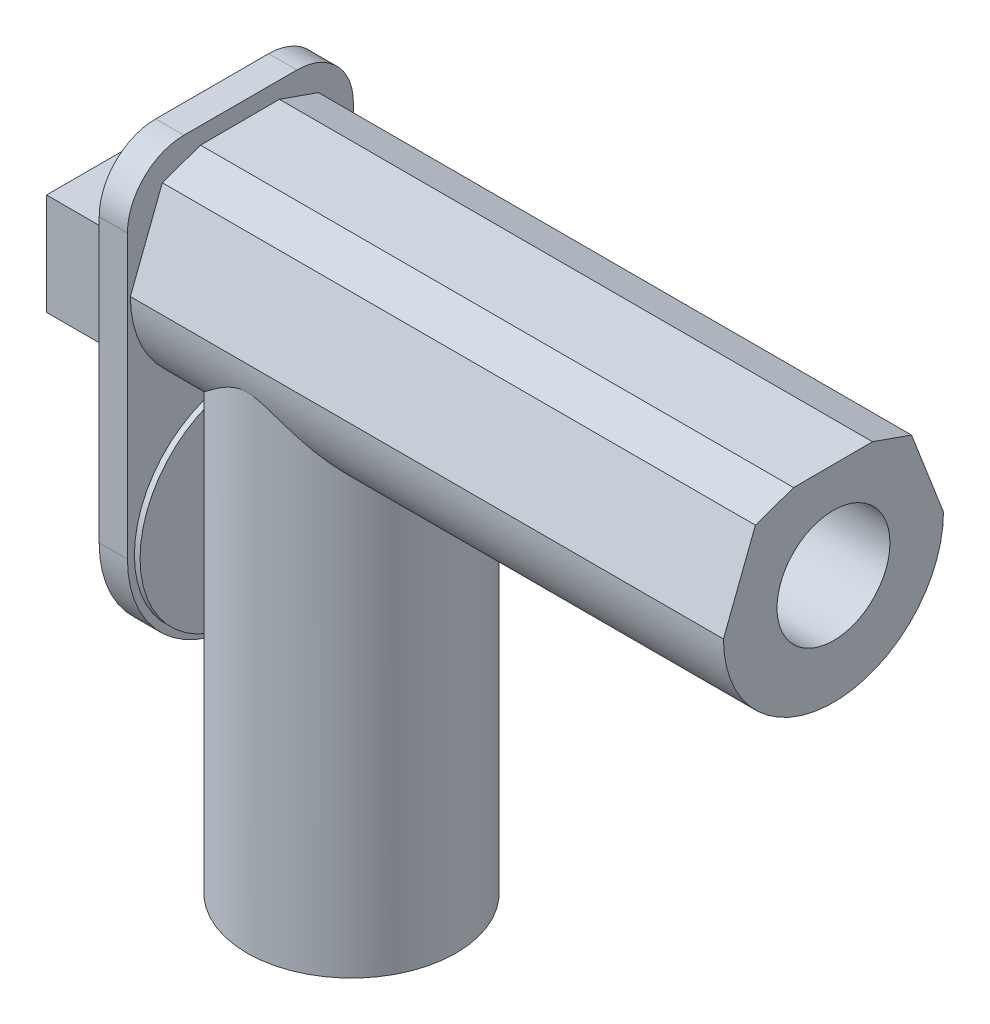
ISO-10303-21;
HEADER;
FILE_DESCRIPTION(('STEP AP214'),'2;1');
FILE_NAME('part.step','',(''),(''),'','','');
FILE_SCHEMA(('AUTOMOTIVE_DESIGN { 1 0 10303 214 1 1 1 1 }'));
ENDSEC;
DATA;
#1=APPLICATION_CONTEXT('core data for automotive mechanical design processes');
#2=APPLICATION_PROTOCOL_DEFINITION('international standard','automotive_design',2000,#1);
#3=PRODUCT_CONTEXT('',#1,'mechanical');
#4=PRODUCT('Part','Part','',(#3));
#5=PRODUCT_RELATED_PRODUCT_CATEGORY('part','',(#4));
#6=PRODUCT_DEFINITION_FORMATION('','',#4);
#7=PRODUCT_DEFINITION_CONTEXT('part definition',#1,'design');
#8=PRODUCT_DEFINITION('design','',#6,#7);
#9=PRODUCT_DEFINITION_SHAPE('','',#8);
#10=(LENGTH_UNIT() NAMED_UNIT(*) SI_UNIT(.MILLI.,.METRE.));
#11=(NAMED_UNIT(*) PLANE_ANGLE_UNIT() SI_UNIT($,.RADIAN.));
#12=(NAMED_UNIT(*) SI_UNIT($,.STERADIAN.) SOLID_ANGLE_UNIT());
#13=UNCERTAINTY_MEASURE_WITH_UNIT(LENGTH_MEASURE(1.E-05),#10,'distance_accuracy_value','');
#14=(GEOMETRIC_REPRESENTATION_CONTEXT(3) GLOBAL_UNCERTAINTY_ASSIGNED_CONTEXT((#13)) GLOBAL_UNIT_ASSIGNED_CONTEXT((#10,
#11,#12)) REPRESENTATION_CONTEXT('',''));
#15=CARTESIAN_POINT('',(0.,0.,0.));
#16=DIRECTION('',(0.,0.,1.));
#17=DIRECTION('',(1.,0.,0.));
#18=AXIS2_PLACEMENT_3D('',#15,#16,#17);
#19=CARTESIAN_POINT('',(21.277447397372,62.4620928878457,19.6760183189742));
#20=DIRECTION('',(-1.,0.,0.));
#21=DIRECTION('',(0.,0.,1.));
#22=AXIS2_PLACEMENT_3D('',#19,#20,#21);
#23=PLANE('',#22);
#24=DIRECTION('',(0.,-1.,0.));
#25=VECTOR('',#24,1.);
#26=CARTESIAN_POINT('',(21.277447397372,42.4620928878458,29.6760183189742));
#27=LINE('',#26,#25);
#28=CARTESIAN_POINT('',(21.277447397372,62.4620928878457,29.6760183189742));
#29=VERTEX_POINT('',#28);
#30=CARTESIAN_POINT('',(21.277447397372,12.4620928878458,29.6760183189742));
#31=VERTEX_POINT('',#30);
#32=EDGE_CURVE('E179',#29,#31,#27,.T.);
#33=ORIENTED_EDGE('',*,*,#32,.T.);
#34=CARTESIAN_POINT('',(21.277447397372,12.4620928878458,9.67601831897421));
#35=DIRECTION('',(1.,0.,0.));
#36=DIRECTION('',(0.,0.,-1.));
#37=AXIS2_PLACEMENT_3D('',#34,#35,#36);
#38=CIRCLE('',#37,20.);
#39=CARTESIAN_POINT('',(21.277447397372,12.4620928878458,-10.3239816810258));
#40=VERTEX_POINT('',#39);
#41=EDGE_CURVE('E181',#31,#40,#38,.T.);
#42=ORIENTED_EDGE('',*,*,#41,.T.);
#43=DIRECTION('',(0.,1.,0.));
#44=VECTOR('',#43,1.);
#45=CARTESIAN_POINT('',(21.277447397372,42.4620928878458,-10.3239816810258));
#46=LINE('',#45,#44);
#47=CARTESIAN_POINT('',(21.277447397372,62.4620928878457,-10.3239816810258));
#48=VERTEX_POINT('',#47);
#49=EDGE_CURVE('E184',#40,#48,#46,.T.);
#50=ORIENTED_EDGE('',*,*,#49,.T.);
#51=CARTESIAN_POINT('',(21.277447397372,62.4620928878457,-0.323981681025794));
#52=DIRECTION('',(1.,0.,0.));
#53=DIRECTION('',(0.,0.,-1.));
#54=AXIS2_PLACEMENT_3D('',#51,#52,#53);
#55=CIRCLE('',#54,10.);
#56=CARTESIAN_POINT('',(21.277447397372,72.4620928878457,-0.323981681025724));
#57=VERTEX_POINT('',#56);
#58=EDGE_CURVE('E186',#48,#57,#55,.T.);
#59=ORIENTED_EDGE('',*,*,#58,.T.);
#60=DIRECTION('',(0.,0.,1.));
#61=VECTOR('',#60,1.);
#62=CARTESIAN_POINT('',(21.277447397372,72.4620928878457,19.6760183189741));
#63=LINE('',#62,#61);
#64=CARTESIAN_POINT('',(21.277447397372,72.4620928878457,19.6760183189741));
#65=VERTEX_POINT('',#64);
#66=EDGE_CURVE('E188',#57,#65,#63,.T.);
#67=ORIENTED_EDGE('',*,*,#66,.T.);
#68=CARTESIAN_POINT('',(21.277447397372,62.4620928878457,19.6760183189742));
#69=DIRECTION('',(1.,0.,0.));
#70=DIRECTION('',(0.,0.,1.));
#71=AXIS2_PLACEMENT_3D('',#68,#69,#70);
#72=CIRCLE('',#71,10.);
#73=EDGE_CURVE('E190',#65,#29,#72,.T.);
#74=ORIENTED_EDGE('',*,*,#73,.T.);
#75=EDGE_LOOP('',(#33,#42,#50,#59,#67,#74));
#76=FACE_BOUND('',#75,.T.);
#77=CARTESIAN_POINT('',(21.277447397372,12.4620928878458,9.67601831897421));
#78=DIRECTION('',(-1.,0.,0.));
#79=DIRECTION('',(0.,0.,1.));
#80=AXIS2_PLACEMENT_3D('',#77,#78,#79);
#81=CIRCLE('',#80,18.7656335170518);
#82=CARTESIAN_POINT('',(21.277447397372,12.4620928878458,28.441651836026));
#83=VERTEX_POINT('',#82);
#84=EDGE_CURVE('E11',#83,#83,#81,.F.);
#85=ORIENTED_EDGE('',*,*,#84,.F.);
#86=EDGE_LOOP('',(#85));
#87=FACE_BOUND('',#86,.T.);
#88=DIRECTION('',(0.,0.331543965634237,0.94343976959397));
#89=VECTOR('',#88,1.);
#90=CARTESIAN_POINT('',(21.277447397372,67.0835790227528,-4.14465558165401));
#91=LINE('',#90,#89);
#92=CARTESIAN_POINT('',(21.277447397372,67.0835790227528,-4.14465558165401));
#93=VERTEX_POINT('',#92);
#94=CARTESIAN_POINT('',(21.277447397372,69.5120122839052,2.7656813686601));
#95=VERTEX_POINT('',#94);
#96=EDGE_CURVE('E169',#93,#95,#91,.T.);
#97=ORIENTED_EDGE('',*,*,#96,.F.);
#98=DIRECTION('',(0.,0.932616433311052,0.360869212205991));
#99=VECTOR('',#98,1.);
#100=CARTESIAN_POINT('',(21.277447397372,52.4620928878457,-9.80233433823765));
#101=LINE('',#100,#99);
#102=CARTESIAN_POINT('',(21.277447397372,52.4620928878457,-9.80233433823765));
#103=VERTEX_POINT('',#102);
#104=EDGE_CURVE('E166',#103,#93,#101,.T.);
#105=ORIENTED_EDGE('',*,*,#104,.F.);
#106=CARTESIAN_POINT('',(21.277447397372,52.4620928878457,9.67601831897421));
#107=DIRECTION('',(1.,0.,0.));
#108=DIRECTION('',(0.,0.,-1.));
#109=AXIS2_PLACEMENT_3D('',#106,#107,#108);
#110=CIRCLE('',#109,19.4783526572119);
#111=CARTESIAN_POINT('',(21.277447397372,52.4620928878457,29.1543709761861));
#112=VERTEX_POINT('',#111);
#113=EDGE_CURVE('E391',#112,#103,#110,.T.);
#114=ORIENTED_EDGE('',*,*,#113,.F.);
#115=DIRECTION('',(0.,-0.932616433311052,0.360869212205991));
#116=VECTOR('',#115,1.);
#117=CARTESIAN_POINT('',(21.277447397372,52.4620928878457,29.1543709761861));
#118=LINE('',#117,#116);
#119=CARTESIAN_POINT('',(21.277447397372,67.0835790227528,23.4966922196024));
#120=VERTEX_POINT('',#119);
#121=EDGE_CURVE('E388',#120,#112,#118,.T.);
#122=ORIENTED_EDGE('',*,*,#121,.F.);
#123=DIRECTION('',(0.,-0.331543965634237,0.94343976959397));
#124=VECTOR('',#123,1.);
#125=CARTESIAN_POINT('',(21.277447397372,67.0835790227528,23.4966922196024));
#126=LINE('',#125,#124);
#127=CARTESIAN_POINT('',(21.277447397372,69.463174846037,16.7253268263238));
#128=VERTEX_POINT('',#127);
#129=EDGE_CURVE('E56',#128,#120,#126,.T.);
#130=ORIENTED_EDGE('',*,*,#129,.F.);
#131=DIRECTION('',(0.,-0.00349845124295916,0.999993880400726));
#132=VECTOR('',#131,1.);
#133=CARTESIAN_POINT('',(21.277447397372,69.463174846037,16.7253268263238));
#134=LINE('',#133,#132);
#135=EDGE_CURVE('E51',#95,#128,#134,.T.);
#136=ORIENTED_EDGE('',*,*,#135,.F.);
#137=EDGE_LOOP('',(#97,#105,#114,#122,#130,#136));
#138=FACE_BOUND('',#137,.T.);
#139=ADVANCED_FACE('F34',(#76,#87,#138),#23,.F.);
#140=CARTESIAN_POINT('',(-2.72255260262796,51.4620928878458,20.));
#141=DIRECTION('',(1.,0.,0.));
#142=DIRECTION('',(0.,0.,-1.));
#143=AXIS2_PLACEMENT_3D('',#140,#141,#142);
#144=PLANE('',#143);
#145=DIRECTION('',(0.,-1.,0.));
#146=VECTOR('',#145,1.);
#147=CARTESIAN_POINT('',(-2.72255260262796,51.4620928878458,0.));
#148=LINE('',#147,#146);
#149=CARTESIAN_POINT('',(-2.72255260262796,51.4620928878458,0.));
#150=VERTEX_POINT('',#149);
#151=CARTESIAN_POINT('',(-2.72255260262796,33.4620928878458,0.));
#152=VERTEX_POINT('',#151);
#153=EDGE_CURVE('E222',#150,#152,#148,.T.);
#154=ORIENTED_EDGE('',*,*,#153,.T.);
#155=DIRECTION('',(0.,0.,-1.));
#156=VECTOR('',#155,1.);
#157=CARTESIAN_POINT('',(-2.72255260262796,33.4620928878458,20.));
#158=LINE('',#157,#156);
#159=CARTESIAN_POINT('',(-2.72255260262796,33.4620928878458,20.));
#160=VERTEX_POINT('',#159);
#161=EDGE_CURVE('E43',#160,#152,#158,.T.);
#162=ORIENTED_EDGE('',*,*,#161,.F.);
#163=DIRECTION('',(0.,-1.,0.));
#164=VECTOR('',#163,1.);
#165=CARTESIAN_POINT('',(-2.72255260262796,51.4620928878458,20.));
#166=LINE('',#165,#164);
#167=CARTESIAN_POINT('',(-2.72255260262796,51.4620928878458,20.));
#168=VERTEX_POINT('',#167);
#169=EDGE_CURVE('E223',#168,#160,#166,.T.);
#170=ORIENTED_EDGE('',*,*,#169,.F.);
#171=DIRECTION('',(0.,0.,-1.));
#172=VECTOR('',#171,1.);
#173=CARTESIAN_POINT('',(-2.72255260262796,51.4620928878458,20.));
#174=LINE('',#173,#172);
#175=EDGE_CURVE('E233',#168,#150,#174,.T.);
#176=ORIENTED_EDGE('',*,*,#175,.T.);
#177=EDGE_LOOP('',(#154,#162,#170,#176));
#178=FACE_BOUND('',#177,.T.);
#179=ADVANCED_FACE('F36',(#178),#144,.F.);
#180=CARTESIAN_POINT('',(-2.72255260262796,33.4620928878458,20.));
#181=DIRECTION('',(0.,1.,0.));
#182=DIRECTION('',(0.,0.,1.));
#183=AXIS2_PLACEMENT_3D('',#180,#181,#182);
#184=PLANE('',#183);
#185=CARTESIAN_POINT('',(7.55700513202386,33.4620928878458,10.));
#186=DIRECTION('',(0.,1.,0.));
#187=DIRECTION('',(0.,0.,1.));
#188=AXIS2_PLACEMENT_3D('',#185,#186,#187);
#189=CIRCLE('',#188,3.5);
#190=CARTESIAN_POINT('',(7.55700513202386,33.4620928878458,13.5));
#191=VERTEX_POINT('',#190);
#192=EDGE_CURVE('E340',#191,#191,#189,.F.);
#193=ORIENTED_EDGE('',*,*,#192,.F.);
#194=EDGE_LOOP('',(#193));
#195=FACE_BOUND('',#194,.T.);
#196=DIRECTION('',(1.,0.,0.));
#197=VECTOR('',#196,1.);
#198=CARTESIAN_POINT('',(-2.72255260262796,33.4620928878458,0.));
#199=LINE('',#198,#197);
#200=CARTESIAN_POINT('',(16.277447397372,33.4620928878458,0.));
#201=VERTEX_POINT('',#200);
#202=EDGE_CURVE('E236',#152,#201,#199,.T.);
#203=ORIENTED_EDGE('',*,*,#202,.T.);
#204=DIRECTION('',(0.,0.,-1.));
#205=VECTOR('',#204,1.);
#206=CARTESIAN_POINT('',(16.277447397372,33.4620928878458,20.));
#207=LINE('',#206,#205);
#208=CARTESIAN_POINT('',(16.277447397372,33.4620928878458,20.));
#209=VERTEX_POINT('',#208);
#210=EDGE_CURVE('E247',#209,#201,#207,.T.);
#211=ORIENTED_EDGE('',*,*,#210,.F.);
#212=DIRECTION('',(1.,0.,0.));
#213=VECTOR('',#212,1.);
#214=CARTESIAN_POINT('',(-2.72255260262796,33.4620928878458,20.));
#215=LINE('',#214,#213);
#216=EDGE_CURVE('E226',#160,#209,#215,.T.);
#217=ORIENTED_EDGE('',*,*,#216,.F.);
#218=ORIENTED_EDGE('',*,*,#161,.T.);
#219=EDGE_LOOP('',(#203,#211,#217,#218));
#220=FACE_BOUND('',#219,.T.);
#221=ADVANCED_FACE('F287',(#195,#220),#184,.F.);
#222=CARTESIAN_POINT('',(-2.72255260262796,51.4620928878458,20.));
#223=DIRECTION('',(0.,-1.,0.));
#224=DIRECTION('',(0.,0.,-1.));
#225=AXIS2_PLACEMENT_3D('',#222,#223,#224);
#226=PLANE('',#225);
#227=CARTESIAN_POINT('',(7.55700513202386,51.4620928878458,10.));
#228=DIRECTION('',(0.,-1.,0.));
#229=DIRECTION('',(0.,0.,-1.));
#230=AXIS2_PLACEMENT_3D('',#227,#228,#229);
#231=CIRCLE('',#230,3.5);
#232=CARTESIAN_POINT('',(7.55700513202386,51.4620928878458,6.5));
#233=VERTEX_POINT('',#232);
#234=EDGE_CURVE('E38',#233,#233,#231,.F.);
#235=ORIENTED_EDGE('',*,*,#234,.F.);
#236=EDGE_LOOP('',(#235));
#237=FACE_BOUND('',#236,.T.);
#238=DIRECTION('',(-1.,0.,0.));
#239=VECTOR('',#238,1.);
#240=CARTESIAN_POINT('',(-2.72255260262796,51.4620928878458,0.));
#241=LINE('',#240,#239);
#242=CARTESIAN_POINT('',(16.277447397372,51.4620928878458,0.));
#243=VERTEX_POINT('',#242);
#244=EDGE_CURVE('E227',#243,#150,#241,.T.);
#245=ORIENTED_EDGE('',*,*,#244,.T.);
#246=ORIENTED_EDGE('',*,*,#175,.F.);
#247=DIRECTION('',(-1.,0.,0.));
#248=VECTOR('',#247,1.);
#249=CARTESIAN_POINT('',(-2.72255260262796,51.4620928878458,20.));
#250=LINE('',#249,#248);
#251=CARTESIAN_POINT('',(16.277447397372,51.4620928878458,20.));
#252=VERTEX_POINT('',#251);
#253=EDGE_CURVE('E231',#252,#168,#250,.T.);
#254=ORIENTED_EDGE('',*,*,#253,.F.);
#255=DIRECTION('',(0.,0.,-1.));
#256=VECTOR('',#255,1.);
#257=CARTESIAN_POINT('',(16.277447397372,51.4620928878458,20.));
#258=LINE('',#257,#256);
#259=EDGE_CURVE('E245',#252,#243,#258,.T.);
#260=ORIENTED_EDGE('',*,*,#259,.T.);
#261=EDGE_LOOP('',(#245,#246,#254,#260));
#262=FACE_BOUND('',#261,.T.);
#263=ADVANCED_FACE('F326',(#237,#262),#226,.F.);
#264=CARTESIAN_POINT('',(0.,0.,20.));
#265=DIRECTION('',(0.,0.,1.));
#266=DIRECTION('',(1.,0.,0.));
#267=AXIS2_PLACEMENT_3D('',#264,#265,#266);
#268=PLANE('',#267);
#269=ORIENTED_EDGE('',*,*,#169,.T.);
#270=ORIENTED_EDGE('',*,*,#216,.T.);
#271=DIRECTION('',(0.,1.,0.));
#272=VECTOR('',#271,1.);
#273=CARTESIAN_POINT('',(16.277447397372,51.4620928878458,20.));
#274=LINE('',#273,#272);
#275=EDGE_CURVE('E229',#209,#252,#274,.T.);
#276=ORIENTED_EDGE('',*,*,#275,.T.);
#277=ORIENTED_EDGE('',*,*,#253,.T.);
#278=EDGE_LOOP('',(#269,#270,#276,#277));
#279=FACE_BOUND('',#278,.T.);
#280=ADVANCED_FACE('F323',(#279),#268,.T.);
#281=CARTESIAN_POINT('',(0.,0.,0.));
#282=DIRECTION('',(0.,0.,1.));
#283=DIRECTION('',(1.,0.,0.));
#284=AXIS2_PLACEMENT_3D('',#281,#282,#283);
#285=PLANE('',#284);
#286=ORIENTED_EDGE('',*,*,#153,.F.);
#287=ORIENTED_EDGE('',*,*,#244,.F.);
#288=DIRECTION('',(0.,1.,0.));
#289=VECTOR('',#288,1.);
#290=CARTESIAN_POINT('',(16.277447397372,51.4620928878458,0.));
#291=LINE('',#290,#289);
#292=EDGE_CURVE('E239',#201,#243,#291,.T.);
#293=ORIENTED_EDGE('',*,*,#292,.F.);
#294=ORIENTED_EDGE('',*,*,#202,.F.);
#295=EDGE_LOOP('',(#286,#287,#293,#294));
#296=FACE_BOUND('',#295,.T.);
#297=ADVANCED_FACE('F321',(#296),#285,.F.);
#298=CARTESIAN_POINT('',(21.277447397372,12.4620928878458,29.6760183189742));
#299=DIRECTION('',(0.,0.,-1.));
#300=DIRECTION('',(0.,1.,0.));
#301=AXIS2_PLACEMENT_3D('',#298,#299,#300);
#302=PLANE('',#301);
#303=DIRECTION('',(0.,-1.,0.));
#304=VECTOR('',#303,1.);
#305=CARTESIAN_POINT('',(16.277447397372,12.4620928878458,29.6760183189742));
#306=LINE('',#305,#304);
#307=CARTESIAN_POINT('',(16.277447397372,62.4620928878457,29.6760183189742));
#308=VERTEX_POINT('',#307);
#309=CARTESIAN_POINT('',(16.277447397372,12.4620928878458,29.6760183189742));
#310=VERTEX_POINT('',#309);
#311=EDGE_CURVE('E173',#308,#310,#306,.T.);
#312=ORIENTED_EDGE('',*,*,#311,.T.);
#313=DIRECTION('',(-1.,0.,0.));
#314=VECTOR('',#313,1.);
#315=CARTESIAN_POINT('',(21.277447397372,12.4620928878458,29.6760183189742));
#316=LINE('',#315,#314);
#317=EDGE_CURVE('E219',#31,#310,#316,.T.);
#318=ORIENTED_EDGE('',*,*,#317,.F.);
#319=ORIENTED_EDGE('',*,*,#32,.F.);
#320=DIRECTION('',(-1.,0.,0.));
#321=VECTOR('',#320,1.);
#322=CARTESIAN_POINT('',(21.277447397372,62.4620928878457,29.6760183189742));
#323=LINE('',#322,#321);
#324=EDGE_CURVE('E192',#29,#308,#323,.T.);
#325=ORIENTED_EDGE('',*,*,#324,.T.);
#326=EDGE_LOOP('',(#312,#318,#319,#325));
#327=FACE_BOUND('',#326,.T.);
#328=ADVANCED_FACE('F317',(#327),#302,.F.);
#329=CARTESIAN_POINT('',(21.277447397372,12.4620928878458,9.67601831897421));
#330=DIRECTION('',(-1.,0.,0.));
#331=DIRECTION('',(0.,0.,1.));
#332=AXIS2_PLACEMENT_3D('',#329,#330,#331);
#333=CYLINDRICAL_SURFACE('',#332,20.);
#334=CARTESIAN_POINT('',(16.277447397372,12.4620928878458,9.67601831897421));
#335=DIRECTION('',(1.,0.,0.));
#336=DIRECTION('',(0.,0.,-1.));
#337=AXIS2_PLACEMENT_3D('',#334,#335,#336);
#338=CIRCLE('',#337,20.);
#339=CARTESIAN_POINT('',(16.277447397372,12.4620928878458,-10.3239816810258));
#340=VERTEX_POINT('',#339);
#341=EDGE_CURVE('E194',#310,#340,#338,.T.);
#342=ORIENTED_EDGE('',*,*,#341,.T.);
#343=DIRECTION('',(-1.,0.,0.));
#344=VECTOR('',#343,1.);
#345=CARTESIAN_POINT('',(21.277447397372,12.4620928878458,-10.3239816810258));
#346=LINE('',#345,#344);
#347=EDGE_CURVE('E216',#40,#340,#346,.T.);
#348=ORIENTED_EDGE('',*,*,#347,.F.);
#349=ORIENTED_EDGE('',*,*,#41,.F.);
#350=ORIENTED_EDGE('',*,*,#317,.T.);
#351=EDGE_LOOP('',(#342,#348,#349,#350));
#352=FACE_BOUND('',#351,.T.);
#353=ADVANCED_FACE('F313',(#352),#333,.T.);
#354=CARTESIAN_POINT('',(21.277447397372,62.4620928878457,-10.3239816810258));
#355=DIRECTION('',(0.,0.,1.));
#356=DIRECTION('',(0.,-1.,0.));
#357=AXIS2_PLACEMENT_3D('',#354,#355,#356);
#358=PLANE('',#357);
#359=DIRECTION('',(0.,1.,0.));
#360=VECTOR('',#359,1.);
#361=CARTESIAN_POINT('',(16.277447397372,62.4620928878457,-10.3239816810258));
#362=LINE('',#361,#360);
#363=CARTESIAN_POINT('',(16.277447397372,62.4620928878457,-10.3239816810258));
#364=VERTEX_POINT('',#363);
#365=EDGE_CURVE('E197',#340,#364,#362,.T.);
#366=ORIENTED_EDGE('',*,*,#365,.T.);
#367=DIRECTION('',(-1.,0.,0.));
#368=VECTOR('',#367,1.);
#369=CARTESIAN_POINT('',(21.277447397372,62.4620928878457,-10.3239816810258));
#370=LINE('',#369,#368);
#371=EDGE_CURVE('E213',#48,#364,#370,.T.);
#372=ORIENTED_EDGE('',*,*,#371,.F.);
#373=ORIENTED_EDGE('',*,*,#49,.F.);
#374=ORIENTED_EDGE('',*,*,#347,.T.);
#375=EDGE_LOOP('',(#366,#372,#373,#374));
#376=FACE_BOUND('',#375,.T.);
#377=ADVANCED_FACE('F309',(#376),#358,.F.);
#378=CARTESIAN_POINT('',(21.277447397372,62.4620928878457,-0.323981681025794));
#379=DIRECTION('',(-1.,0.,0.));
#380=DIRECTION('',(0.,0.,1.));
#381=AXIS2_PLACEMENT_3D('',#378,#379,#380);
#382=CYLINDRICAL_SURFACE('',#381,10.);
#383=CARTESIAN_POINT('',(16.277447397372,62.4620928878457,-0.323981681025794));
#384=DIRECTION('',(1.,0.,0.));
#385=DIRECTION('',(0.,0.,-1.));
#386=AXIS2_PLACEMENT_3D('',#383,#384,#385);
#387=CIRCLE('',#386,10.);
#388=CARTESIAN_POINT('',(16.277447397372,72.4620928878457,-0.323981681025724));
#389=VERTEX_POINT('',#388);
#390=EDGE_CURVE('E199',#364,#389,#387,.T.);
#391=ORIENTED_EDGE('',*,*,#390,.T.);
#392=DIRECTION('',(-1.,0.,0.));
#393=VECTOR('',#392,1.);
#394=CARTESIAN_POINT('',(21.277447397372,72.4620928878457,-0.323981681025724));
#395=LINE('',#394,#393);
#396=EDGE_CURVE('E210',#57,#389,#395,.T.);
#397=ORIENTED_EDGE('',*,*,#396,.F.);
#398=ORIENTED_EDGE('',*,*,#58,.F.);
#399=ORIENTED_EDGE('',*,*,#371,.T.);
#400=EDGE_LOOP('',(#391,#397,#398,#399));
#401=FACE_BOUND('',#400,.T.);
#402=ADVANCED_FACE('F305',(#401),#382,.T.);
#403=CARTESIAN_POINT('',(21.277447397372,72.4620928878457,19.6760183189741));
#404=DIRECTION('',(0.,-1.,0.));
#405=DIRECTION('',(0.,0.,-1.));
#406=AXIS2_PLACEMENT_3D('',#403,#404,#405);
#407=PLANE('',#406);
#408=DIRECTION('',(0.,0.,1.));
#409=VECTOR('',#408,1.);
#410=CARTESIAN_POINT('',(16.277447397372,72.4620928878457,19.6760183189741));
#411=LINE('',#410,#409);
#412=CARTESIAN_POINT('',(16.277447397372,72.4620928878457,19.6760183189741));
#413=VERTEX_POINT('',#412);
#414=EDGE_CURVE('E201',#389,#413,#411,.T.);
#415=ORIENTED_EDGE('',*,*,#414,.T.);
#416=DIRECTION('',(-1.,0.,0.));
#417=VECTOR('',#416,1.);
#418=CARTESIAN_POINT('',(21.277447397372,72.4620928878457,19.6760183189741));
#419=LINE('',#418,#417);
#420=EDGE_CURVE('E207',#65,#413,#419,.T.);
#421=ORIENTED_EDGE('',*,*,#420,.F.);
#422=ORIENTED_EDGE('',*,*,#66,.F.);
#423=ORIENTED_EDGE('',*,*,#396,.T.);
#424=EDGE_LOOP('',(#415,#421,#422,#423));
#425=FACE_BOUND('',#424,.T.);
#426=ADVANCED_FACE('F301',(#425),#407,.F.);
#427=CARTESIAN_POINT('',(21.277447397372,62.4620928878457,19.6760183189742));
#428=DIRECTION('',(-1.,0.,0.));
#429=DIRECTION('',(0.,0.,1.));
#430=AXIS2_PLACEMENT_3D('',#427,#428,#429);
#431=CYLINDRICAL_SURFACE('',#430,10.);
#432=CARTESIAN_POINT('',(16.277447397372,62.4620928878457,19.6760183189742));
#433=DIRECTION('',(1.,0.,0.));
#434=DIRECTION('',(0.,0.,1.));
#435=AXIS2_PLACEMENT_3D('',#432,#433,#434);
#436=CIRCLE('',#435,10.);
#437=EDGE_CURVE('E182',#413,#308,#436,.T.);
#438=ORIENTED_EDGE('',*,*,#437,.T.);
#439=ORIENTED_EDGE('',*,*,#324,.F.);
#440=ORIENTED_EDGE('',*,*,#73,.F.);
#441=ORIENTED_EDGE('',*,*,#420,.T.);
#442=EDGE_LOOP('',(#438,#439,#440,#441));
#443=FACE_BOUND('',#442,.T.);
#444=ADVANCED_FACE('F297',(#443),#431,.T.);
#445=CARTESIAN_POINT('',(16.277447397372,62.4620928878457,19.6760183189742));
#446=DIRECTION('',(-1.,0.,0.));
#447=DIRECTION('',(0.,0.,1.));
#448=AXIS2_PLACEMENT_3D('',#445,#446,#447);
#449=PLANE('',#448);
#450=ORIENTED_EDGE('',*,*,#210,.T.);
#451=ORIENTED_EDGE('',*,*,#292,.T.);
#452=ORIENTED_EDGE('',*,*,#259,.F.);
#453=ORIENTED_EDGE('',*,*,#275,.F.);
#454=EDGE_LOOP('',(#450,#451,#452,#453));
#455=FACE_BOUND('',#454,.T.);
#456=ORIENTED_EDGE('',*,*,#311,.F.);
#457=ORIENTED_EDGE('',*,*,#437,.F.);
#458=ORIENTED_EDGE('',*,*,#414,.F.);
#459=ORIENTED_EDGE('',*,*,#390,.F.);
#460=ORIENTED_EDGE('',*,*,#365,.F.);
#461=ORIENTED_EDGE('',*,*,#341,.F.);
#462=EDGE_LOOP('',(#456,#457,#458,#459,#460,#461));
#463=FACE_BOUND('',#462,.T.);
#464=ADVANCED_FACE('F294',(#455,#463),#449,.T.);
#465=CARTESIAN_POINT('',(22.277447397372,12.4620928878458,9.67601831897421));
#466=DIRECTION('',(-1.,0.,0.));
#467=DIRECTION('',(0.,0.,1.));
#468=AXIS2_PLACEMENT_3D('',#465,#466,#467);
#469=CYLINDRICAL_SURFACE('',#468,18.7656335170518);
#470=CARTESIAN_POINT('',(22.277447397372,12.4620928878458,9.67601831897421));
#471=DIRECTION('',(1.,0.,0.));
#472=DIRECTION('',(0.,0.,-1.));
#473=AXIS2_PLACEMENT_3D('',#470,#471,#472);
#474=CIRCLE('',#473,18.7656335170518);
#475=CARTESIAN_POINT('',(22.277447397372,12.4620928878458,-9.08961519807756));
#476=VERTEX_POINT('',#475);
#477=EDGE_CURVE('E170',#476,#476,#474,.T.);
#478=ORIENTED_EDGE('',*,*,#477,.F.);
#479=EDGE_LOOP('',(#478));
#480=FACE_BOUND('',#479,.T.);
#481=ORIENTED_EDGE('',*,*,#84,.T.);
#482=EDGE_LOOP('',(#481));
#483=FACE_BOUND('',#482,.T.);
#484=ADVANCED_FACE('F292',(#480,#483),#469,.T.);
#485=CARTESIAN_POINT('',(22.277447397372,12.4620928878458,9.67601831897421));
#486=DIRECTION('',(1.,0.,0.));
#487=DIRECTION('',(0.,0.,-1.));
#488=AXIS2_PLACEMENT_3D('',#485,#486,#487);
#489=PLANE('',#488);
#490=ORIENTED_EDGE('',*,*,#477,.T.);
#491=EDGE_LOOP('',(#490));
#492=FACE_BOUND('',#491,.T.);
#493=ADVANCED_FACE('F420',(#492),#489,.T.);
#494=CARTESIAN_POINT('',(126.277447397372,67.0835790227528,-4.14465558165401));
#495=DIRECTION('',(0.,-0.94343976959397,0.331543965634237));
#496=DIRECTION('',(0.,-0.331543965634237,-0.94343976959397));
#497=AXIS2_PLACEMENT_3D('',#494,#495,#496);
#498=PLANE('',#497);
#499=ORIENTED_EDGE('',*,*,#96,.T.);
#500=DIRECTION('',(-1.,0.,0.));
#501=VECTOR('',#500,1.);
#502=CARTESIAN_POINT('',(126.277447397372,69.5120122839052,2.7656813686601));
#503=LINE('',#502,#501);
#504=CARTESIAN_POINT('',(126.277447397372,69.5120122839052,2.7656813686601));
#505=VERTEX_POINT('',#504);
#506=EDGE_CURVE('E150',#505,#95,#503,.T.);
#507=ORIENTED_EDGE('',*,*,#506,.F.);
#508=DIRECTION('',(0.,0.331543965634237,0.94343976959397));
#509=VECTOR('',#508,1.);
#510=CARTESIAN_POINT('',(126.277447397372,67.0835790227528,-4.14465558165401));
#511=LINE('',#510,#509);
#512=CARTESIAN_POINT('',(126.277447397372,67.0835790227528,-4.14465558165401));
#513=VERTEX_POINT('',#512);
#514=EDGE_CURVE('E157',#513,#505,#511,.T.);
#515=ORIENTED_EDGE('',*,*,#514,.F.);
#516=DIRECTION('',(-1.,0.,0.));
#517=VECTOR('',#516,1.);
#518=CARTESIAN_POINT('',(126.277447397372,67.0835790227528,-4.14465558165401));
#519=LINE('',#518,#517);
#520=EDGE_CURVE('E384',#513,#93,#519,.T.);
#521=ORIENTED_EDGE('',*,*,#520,.T.);
#522=EDGE_LOOP('',(#499,#507,#515,#521));
#523=FACE_BOUND('',#522,.T.);
#524=ADVANCED_FACE('F168',(#523),#498,.F.);
#525=CARTESIAN_POINT('',(126.277447397372,69.463174846037,16.7253268263238));
#526=DIRECTION('',(0.,-0.999993880400726,-0.00349845124295916));
#527=DIRECTION('',(0.,0.00349845124295916,-0.999993880400726));
#528=AXIS2_PLACEMENT_3D('',#525,#526,#527);
#529=PLANE('',#528);
#530=ORIENTED_EDGE('',*,*,#135,.T.);
#531=DIRECTION('',(-1.,0.,0.));
#532=VECTOR('',#531,1.);
#533=CARTESIAN_POINT('',(126.277447397372,69.463174846037,16.7253268263238));
#534=LINE('',#533,#532);
#535=CARTESIAN_POINT('',(126.277447397372,69.463174846037,16.7253268263238));
#536=VERTEX_POINT('',#535);
#537=EDGE_CURVE('E153',#536,#128,#534,.T.);
#538=ORIENTED_EDGE('',*,*,#537,.F.);
#539=DIRECTION('',(0.,-0.00349845124295916,0.999993880400726));
#540=VECTOR('',#539,1.);
#541=CARTESIAN_POINT('',(126.277447397372,69.463174846037,16.7253268263238));
#542=LINE('',#541,#540);
#543=EDGE_CURVE('E146',#505,#536,#542,.T.);
#544=ORIENTED_EDGE('',*,*,#543,.F.);
#545=ORIENTED_EDGE('',*,*,#506,.T.);
#546=EDGE_LOOP('',(#530,#538,#544,#545));
#547=FACE_BOUND('',#546,.T.);
#548=ADVANCED_FACE('F148',(#547),#529,.F.);
#549=CARTESIAN_POINT('',(126.277447397372,67.0835790227528,23.4966922196024));
#550=DIRECTION('',(0.,-0.94343976959397,-0.331543965634237));
#551=DIRECTION('',(0.,0.331543965634237,-0.943439769593971));
#552=AXIS2_PLACEMENT_3D('',#549,#550,#551);
#553=PLANE('',#552);
#554=ORIENTED_EDGE('',*,*,#129,.T.);
#555=DIRECTION('',(-1.,0.,0.));
#556=VECTOR('',#555,1.);
#557=CARTESIAN_POINT('',(126.277447397372,67.0835790227528,23.4966922196024));
#558=LINE('',#557,#556);
#559=CARTESIAN_POINT('',(126.277447397372,67.0835790227528,23.4966922196024));
#560=VERTEX_POINT('',#559);
#561=EDGE_CURVE('E175',#560,#120,#558,.T.);
#562=ORIENTED_EDGE('',*,*,#561,.F.);
#563=DIRECTION('',(0.,-0.331543965634237,0.94343976959397));
#564=VECTOR('',#563,1.);
#565=CARTESIAN_POINT('',(126.277447397372,67.0835790227528,23.4966922196024));
#566=LINE('',#565,#564);
#567=EDGE_CURVE('E156',#536,#560,#566,.T.);
#568=ORIENTED_EDGE('',*,*,#567,.F.);
#569=ORIENTED_EDGE('',*,*,#537,.T.);
#570=EDGE_LOOP('',(#554,#562,#568,#569));
#571=FACE_BOUND('',#570,.T.);
#572=ADVANCED_FACE('F407',(#571),#553,.F.);
#573=CARTESIAN_POINT('',(126.277447397372,52.4620928878457,29.1543709761861));
#574=DIRECTION('',(0.,-0.360869212205991,-0.932616433311052));
#575=DIRECTION('',(0.,0.932616433311052,-0.360869212205991));
#576=AXIS2_PLACEMENT_3D('',#573,#574,#575);
#577=PLANE('',#576);
#578=ORIENTED_EDGE('',*,*,#121,.T.);
#579=DIRECTION('',(-1.,0.,0.));
#580=VECTOR('',#579,1.);
#581=CARTESIAN_POINT('',(126.277447397372,52.4620928878457,29.1543709761861));
#582=LINE('',#581,#580);
#583=CARTESIAN_POINT('',(126.277447397372,52.4620928878457,29.1543709761861));
#584=VERTEX_POINT('',#583);
#585=EDGE_CURVE('E399',#584,#112,#582,.T.);
#586=ORIENTED_EDGE('',*,*,#585,.F.);
#587=DIRECTION('',(0.,-0.932616433311052,0.360869212205991));
#588=VECTOR('',#587,1.);
#589=CARTESIAN_POINT('',(126.277447397372,52.4620928878457,29.1543709761861));
#590=LINE('',#589,#588);
#591=EDGE_CURVE('E379',#560,#584,#590,.T.);
#592=ORIENTED_EDGE('',*,*,#591,.F.);
#593=ORIENTED_EDGE('',*,*,#561,.T.);
#594=EDGE_LOOP('',(#578,#586,#592,#593));
#595=FACE_BOUND('',#594,.T.);
#596=ADVANCED_FACE('F278',(#595),#577,.F.);
#597=CARTESIAN_POINT('',(126.277447397372,52.4620928878457,9.67601831897421));
#598=DIRECTION('',(-1.,0.,0.));
#599=DIRECTION('',(0.,0.,1.));
#600=AXIS2_PLACEMENT_3D('',#597,#598,#599);
#601=CYLINDRICAL_SURFACE('',#600,19.4783526572119);
#602=CARTESIAN_POINT('',(41.277447397372,47.4557033793159,28.5));
#603=CARTESIAN_POINT('',(41.4402108694923,47.4557016237518,28.4999997115203));
#604=CARTESIAN_POINT('',(41.6029809931165,47.4475720227333,28.4978432920343));
#605=CARTESIAN_POINT('',(41.9268339361448,47.4156564918964,28.4893102987769));
#606=CARTESIAN_POINT('',(42.0879164911489,47.3918681449369,28.4829330734657));
#607=CARTESIAN_POINT('',(42.567803086945,47.2989614494749,28.4577241969661));
#608=CARTESIAN_POINT('',(42.8821937966033,47.2083166958168,28.4328175110616));
#609=CARTESIAN_POINT('',(43.4388784510223,47.0066919373291,28.3750452153025));
#610=CARTESIAN_POINT('',(43.6839761555796,46.9022928920202,28.3444139872158));
#611=CARTESIAN_POINT('',(44.1640889146259,46.6743560718883,28.2750118445807));
#612=CARTESIAN_POINT('',(44.3990945411112,46.5508008776126,28.2362335100314));
#613=CARTESIAN_POINT('',(44.8608612746969,46.2900292428422,28.1511565800813));
#614=CARTESIAN_POINT('',(45.0875934157273,46.152770117826,28.1048341848586));
#615=CARTESIAN_POINT('',(45.5334615075156,45.86901399789,28.0052345054749));
#616=CARTESIAN_POINT('',(45.7525998713114,45.7225199799959,27.9519594567534));
#617=CARTESIAN_POINT('',(46.2254994240777,45.3946844343498,27.8279932233048));
#618=CARTESIAN_POINT('',(46.4779584143899,45.2119973417235,27.7559144528406));
#619=CARTESIAN_POINT('',(46.9755882168745,44.8406150452469,27.6025270879716));
#620=CARTESIAN_POINT('',(47.2207574913937,44.6519185909567,27.5212165634562));
#621=CARTESIAN_POINT('',(47.7050204364879,44.2705799945162,27.34941937184));
#622=CARTESIAN_POINT('',(47.9441097144321,44.0779351716215,27.2589262936488));
#623=CARTESIAN_POINT('',(48.4167726423409,43.6903749052474,27.0688278921629));
#624=CARTESIAN_POINT('',(48.6503457965,43.4954592599934,26.9692217536516));
#625=CARTESIAN_POINT('',(49.343993346755,42.9087576086219,26.6564872590485));
#626=CARTESIAN_POINT('',(49.7965846959702,42.5153465768635,26.4295892705168));
#627=CARTESIAN_POINT('',(50.6832257630579,41.7312939433728,25.9385648099813));
#628=CARTESIAN_POINT('',(51.1172808745922,41.3406515639968,25.6744492650307));
#629=CARTESIAN_POINT('',(52.0586627036969,40.4833410352064,25.0466270938261));
#630=CARTESIAN_POINT('',(52.5615673878348,40.0184750401836,24.6737310420013));
#631=CARTESIAN_POINT('',(53.5372174365364,39.1078318761747,23.8689605325425));
#632=CARTESIAN_POINT('',(54.0099496498533,38.6620630585157,23.4370606110601));
#633=CARTESIAN_POINT('',(54.9185154102498,37.7991619506406,22.5135616844034));
#634=CARTESIAN_POINT('',(55.3544599355941,37.3819443063384,22.022153983319));
#635=CARTESIAN_POINT('',(55.9759356630704,36.7837235690734,21.2390119546486));
#636=CARTESIAN_POINT('',(56.1776322788628,36.5889713822271,20.9703795153418));
#637=CARTESIAN_POINT('',(56.5692556541998,36.2097682173378,20.417550499886));
#638=CARTESIAN_POINT('',(56.7591803637743,36.0253190340185,20.1333512290563));
#639=CARTESIAN_POINT('',(57.1553925797401,35.6394688641157,19.5026779432286));
#640=CARTESIAN_POINT('',(57.3594165201269,35.4400959998354,19.153528115492));
#641=CARTESIAN_POINT('',(57.7476277368657,35.0594768137445,18.4350353681584));
#642=CARTESIAN_POINT('',(57.9318215528617,34.8782245174891,18.065699166645));
#643=CARTESIAN_POINT('',(58.2780388891665,34.5362602334186,17.307761319828));
#644=CARTESIAN_POINT('',(58.4400708055573,34.3755404683416,16.9191670469217));
#645=CARTESIAN_POINT('',(58.7395983485146,34.077053572338,16.1240304354456));
#646=CARTESIAN_POINT('',(58.8770930611407,33.9392872963757,15.7174874290403));
#647=CARTESIAN_POINT('',(59.1262692873343,33.6879919128068,14.88468988586));
#648=CARTESIAN_POINT('',(59.2376959480966,33.5747028640097,14.4582859574701));
#649=CARTESIAN_POINT('',(59.4307409026815,33.3763348852348,13.5923090620187));
#650=CARTESIAN_POINT('',(59.5123592392871,33.2912559147679,13.1527361138594));
#651=CARTESIAN_POINT('',(59.6438217504883,33.1512600159547,12.2644447959447));
#652=CARTESIAN_POINT('',(59.6936898858061,33.0963203469165,11.8157335870528));
#653=CARTESIAN_POINT('',(59.760434520102,33.0177928489508,10.9131588857572));
#654=CARTESIAN_POINT('',(59.7773157315567,32.9942005419267,10.4592961386161));
#655=CARTESIAN_POINT('',(59.7775602703661,32.9798598173485,9.61121036729846));
#656=CARTESIAN_POINT('',(59.765064140293,32.985177628183,9.2170444367342));
#657=CARTESIAN_POINT('',(59.7150266424098,33.0195708565285,8.43138135446351));
#658=CARTESIAN_POINT('',(59.6774878771971,33.0486438053179,8.03988392969895));
#659=CARTESIAN_POINT('',(59.5779777209851,33.1299000766124,7.26244614470764));
#660=CARTESIAN_POINT('',(59.5160056092848,33.1820840808211,6.87650594874844));
#661=CARTESIAN_POINT('',(59.368633614939,33.3085136031146,6.11281151030409));
#662=CARTESIAN_POINT('',(59.2832329225057,33.3827598837697,5.73505755125597));
#663=CARTESIAN_POINT('',(59.0924094765111,33.5501095028787,4.99811398646272));
#664=CARTESIAN_POINT('',(58.9874620484369,33.6427680928758,4.63869935725458));
#665=CARTESIAN_POINT('',(58.7578075194351,33.8464135639625,3.93162333647083));
#666=CARTESIAN_POINT('',(58.6331013816067,33.9573995517306,3.58396137303652));
#667=CARTESIAN_POINT('',(58.3654010688779,34.1961354367319,2.90167990166543));
#668=CARTESIAN_POINT('',(58.2224055972492,34.3238865226405,2.5670613207119));
#669=CARTESIAN_POINT('',(57.9196133734233,34.5945472979613,1.9118211417225));
#670=CARTESIAN_POINT('',(57.7598131077409,34.7374601573975,1.59120249065076));
#671=CARTESIAN_POINT('',(57.3481292124149,35.1054336409834,0.821145052012966));
#672=CARTESIAN_POINT('',(57.0875878123396,35.3381435002037,0.379948949971218));
#673=CARTESIAN_POINT('',(56.5379576607931,35.8276989262285,-0.470112378286232));
#674=CARTESIAN_POINT('',(56.2488581890247,36.084553554874,-0.878965358843065));
#675=CARTESIAN_POINT('',(55.6449104463508,36.6186781589979,-1.6650024229649));
#676=CARTESIAN_POINT('',(55.3299975561714,36.8959991842764,-2.04210192367728));
#677=CARTESIAN_POINT('',(54.6780383488169,37.4663407925764,-2.7636442488761));
#678=CARTESIAN_POINT('',(54.3409931592235,37.759360575648,-3.10808873486717));
#679=CARTESIAN_POINT('',(53.5391550001227,38.4502296755526,-3.86696667123063));
#680=CARTESIAN_POINT('',(53.0671761478284,38.8523924582371,-4.26994985380539));
#681=CARTESIAN_POINT('',(52.3358931833534,39.4645958622709,-4.83427118096272));
#682=CARTESIAN_POINT('',(52.0881345804089,39.670247452131,-5.01575561113293));
#683=CARTESIAN_POINT('',(51.5849668198646,40.0834083776372,-5.36551081681308));
#684=CARTESIAN_POINT('',(51.3295584578791,40.2909175185253,-5.53378295992163));
#685=CARTESIAN_POINT('',(50.8113931599837,40.7063187111509,-5.85708160635572));
#686=CARTESIAN_POINT('',(50.5486448057716,40.9142100704177,-6.01212278392888));
#687=CARTESIAN_POINT('',(50.015347153667,41.3291739214466,-6.30926981165142));
#688=CARTESIAN_POINT('',(49.7447986402079,41.536246493186,-6.45137695659547));
#689=CARTESIAN_POINT('',(49.1956435504699,41.9477373134447,-6.72261642025095));
#690=CARTESIAN_POINT('',(48.9170427492267,42.1521573190355,-6.85175775446867));
#691=CARTESIAN_POINT('',(48.3509424413341,42.5563094728661,-7.097100415159));
#692=CARTESIAN_POINT('',(48.0634445989165,42.7560424856854,-7.21330414319475));
#693=CARTESIAN_POINT('',(47.5262987398569,43.1159432583955,-7.41465192812102));
#694=CARTESIAN_POINT('',(47.2781486934742,43.2772401875806,-7.50176773641877));
#695=CARTESIAN_POINT('',(46.7740492717027,43.5923450079762,-7.66657057829557));
#696=CARTESIAN_POINT('',(46.5180998408696,43.746152845928,-7.74425754482728));
#697=CARTESIAN_POINT('',(45.9975928517573,44.0432265394816,-7.88975016311691));
#698=CARTESIAN_POINT('',(45.7330417021022,44.1864999953206,-7.95756297410575));
#699=CARTESIAN_POINT('',(45.1943240621622,44.4585929380499,-8.08271629579634));
#700=CARTESIAN_POINT('',(44.9201602481031,44.587416406619,-8.14005969408094));
#701=CARTESIAN_POINT('',(44.2374879338605,44.8781481281473,-8.26624705357812));
#702=CARTESIAN_POINT('',(43.8230684978468,45.0295815011723,-8.32900495632909));
#703=CARTESIAN_POINT('',(43.1866299206963,45.2109431066253,-8.40245999815115));
#704=CARTESIAN_POINT('',(42.9722554423462,45.2637331094316,-8.42348643246554));
#705=CARTESIAN_POINT('',(42.5393713014743,45.351600832784,-8.45818565902864));
#706=CARTESIAN_POINT('',(42.3208642440187,45.3866893495584,-8.47186293390011));
#707=CARTESIAN_POINT('',(41.8783923934636,45.4374657680323,-8.49157956809485));
#708=CARTESIAN_POINT('',(41.6543935373855,45.4529002472818,-8.49751917870592));
#709=CARTESIAN_POINT('',(41.205875172372,45.4625046632543,-8.50122062108739));
#710=CARTESIAN_POINT('',(40.9813556923654,45.456675754482,-8.49898289684966));
#711=CARTESIAN_POINT('',(40.5337731770397,45.4241308879486,-8.48640458194751));
#712=CARTESIAN_POINT('',(40.3107126569778,45.397385338312,-8.47605251144203));
#713=CARTESIAN_POINT('',(39.8682675241508,45.3246762396549,-8.44758530731638));
#714=CARTESIAN_POINT('',(39.6488837652574,45.2787082891246,-8.42946839569356));
#715=CARTESIAN_POINT('',(39.1569092678239,45.1554746912927,-8.38014516990848));
#716=CARTESIAN_POINT('',(38.8858227292472,45.0731221761357,-8.34673177618298));
#717=CARTESIAN_POINT('',(38.3526849525929,44.8870822408948,-8.26933065770689));
#718=CARTESIAN_POINT('',(38.0906377878835,44.7833853454293,-8.22533823515785));
#719=CARTESIAN_POINT('',(37.574555531166,44.5592828846693,-8.12754355721573));
#720=CARTESIAN_POINT('',(37.3205548268858,44.4388150726628,-8.07370451022654));
#721=CARTESIAN_POINT('',(36.8209816665509,44.1855900182667,-7.95705182509553));
#722=CARTESIAN_POINT('',(36.5754086028754,44.0528336644258,-7.89423883565519));
#723=CARTESIAN_POINT('',(36.0752808189323,43.768789841675,-7.75554393596456));
#724=CARTESIAN_POINT('',(35.8212626425714,43.6168559244441,-7.67906162993922));
#725=CARTESIAN_POINT('',(35.3208790376446,43.3054624208894,-7.51680554736249));
#726=CARTESIAN_POINT('',(35.0745154012334,43.1460010938668,-7.43102961567956));
#727=CARTESIAN_POINT('',(34.5885155158569,42.8216621606258,-7.25037528371857));
#728=CARTESIAN_POINT('',(34.3488844367941,42.6567805922679,-7.15549012281717));
#729=CARTESIAN_POINT('',(33.8759128357845,42.3233896591788,-6.95679952480449));
#730=CARTESIAN_POINT('',(33.6425730343059,42.1548798828912,-6.8529930716917));
#731=CARTESIAN_POINT('',(32.9506789831101,41.645541990802,-6.52801011622723));
#732=CARTESIAN_POINT('',(32.5008232411854,41.3012963077903,-6.29348431610467));
#733=CARTESIAN_POINT('',(31.622594785558,40.6120048053649,-5.78891996323292));
#734=CARTESIAN_POINT('',(31.1942139663181,40.2669593400611,-5.51889495092133));
#735=CARTESIAN_POINT('',(30.3091967631038,39.5414715229845,-4.90870080770302));
#736=CARTESIAN_POINT('',(29.8551568252942,39.1616351727563,-4.56401757808969));
#737=CARTESIAN_POINT('',(28.9744679606868,38.4150177012644,-3.82808630663865));
#738=CARTESIAN_POINT('',(28.547827149854,38.048240462478,-3.43682456470821));
#739=CARTESIAN_POINT('',(27.7263548602835,37.3355854181567,-2.60783205270675));
#740=CARTESIAN_POINT('',(27.3314362192332,36.9896510468845,-2.17023684949299));
#741=CARTESIAN_POINT('',(26.5765951398956,36.3244956600162,-1.24679147030264));
#742=CARTESIAN_POINT('',(26.2166710184429,36.0052733597267,-0.760943617454935));
#743=CARTESIAN_POINT('',(25.6514416826924,35.502280443632,0.0881780782831053));
#744=CARTESIAN_POINT('',(25.4346534388026,35.3088873712655,0.43817359420962));
#745=CARTESIAN_POINT('',(25.0215261472775,34.9399243907703,1.15877008117011));
#746=CARTESIAN_POINT('',(24.8251744439052,34.764343453846,1.52935807913141));
#747=CARTESIAN_POINT('',(24.4551076366123,34.4334754700975,2.29040246898718));
#748=CARTESIAN_POINT('',(24.2813914701256,34.2781874706735,2.68085792705847));
#749=CARTESIAN_POINT('',(23.9590165720712,33.9905311348081,3.48021151788231));
#750=CARTESIAN_POINT('',(23.8103584957556,33.8581633977137,3.88911013255664));
#751=CARTESIAN_POINT('',(23.5392584227771,33.6178041009224,4.72719861759773));
#752=CARTESIAN_POINT('',(23.4170813201105,33.5100583064369,5.15654539408343));
#753=CARTESIAN_POINT('',(23.203109266502,33.3230384273764,6.02886252945444));
#754=CARTESIAN_POINT('',(23.1113143824164,33.2437644054536,6.47183291831626));
#755=CARTESIAN_POINT('',(22.9601160340155,33.1157705228311,7.36725585591725));
#756=CARTESIAN_POINT('',(22.9006852334062,33.0670248711319,7.8197000660725));
#757=CARTESIAN_POINT('',(22.8154319583617,33.0013777582635,8.73001519962009));
#758=CARTESIAN_POINT('',(22.789604323102,32.9844714069881,9.18788527879677));
#759=CARTESIAN_POINT('',(22.7732818991866,32.9831535718931,10.04054224407));
#760=CARTESIAN_POINT('',(22.7783743997367,32.9945514941088,10.4352501350438));
#761=CARTESIAN_POINT('',(22.8136577044576,33.0411982467991,11.2220916309892));
#762=CARTESIAN_POINT('',(22.8438457483625,33.0764444541148,11.6142255142959));
#763=CARTESIAN_POINT('',(22.9286885118242,33.1701768613744,12.3930121311038));
#764=CARTESIAN_POINT('',(22.9833437046955,33.2286635108999,12.7796647584214));
#765=CARTESIAN_POINT('',(23.116091502781,33.3678630540066,13.544848367697));
#766=CARTESIAN_POINT('',(23.19418493406,33.448576730956,13.9233790628991));
#767=CARTESIAN_POINT('',(23.3703913594292,33.6287740664743,14.6613196969584));
#768=CARTESIAN_POINT('',(23.4679955442958,33.7277766065198,15.0209696462326));
#769=CARTESIAN_POINT('',(23.6828461935467,33.9442768274863,15.7285897467326));
#770=CARTESIAN_POINT('',(23.8000916619826,34.0617735706057,16.0765604891012));
#771=CARTESIAN_POINT('',(24.0527222346837,34.3137487542484,16.7595441149903));
#772=CARTESIAN_POINT('',(24.1881093837423,34.4482291089378,17.0945555323403));
#773=CARTESIAN_POINT('',(24.4754897899297,34.7326124646147,17.7506484456888));
#774=CARTESIAN_POINT('',(24.6274865348923,34.8825187044828,18.0717269960849));
#775=CARTESIAN_POINT('',(25.0201145127848,35.2684950639627,18.8438357880459));
#776=CARTESIAN_POINT('',(25.2693241969408,35.5124491769084,19.2866038004573));
#777=CARTESIAN_POINT('',(25.7956758490877,36.0254630364439,20.1398351131058));
#778=CARTESIAN_POINT('',(26.0728281473637,36.294532065181,20.5502863653413));
#779=CARTESIAN_POINT('',(26.6519041685443,36.8542527474626,21.3394694060445));
#780=CARTESIAN_POINT('',(26.9538839324547,37.1449530790452,21.7181253058761));
#781=CARTESIAN_POINT('',(27.5788027071502,37.7436164217322,22.4429146160504));
#782=CARTESIAN_POINT('',(27.9017413450085,38.0515791256694,22.7890486047959));
#783=CARTESIAN_POINT('',(28.6864311865698,38.7956448893961,23.5692182328435));
#784=CARTESIAN_POINT('',(29.1560686952438,39.2377335037155,23.9896390207334));
#785=CARTESIAN_POINT('',(30.1247904263843,40.1402035592347,24.7735190784777));
#786=CARTESIAN_POINT('',(30.623889874629,40.6005944180899,25.1369485344281));
#787=CARTESIAN_POINT('',(31.3922294191705,41.2986237018014,25.6405251800079));
#788=CARTESIAN_POINT('',(31.6515486528311,41.5324738332528,25.8014167388179));
#789=CARTESIAN_POINT('',(32.1767978093404,42.0016620006486,26.1096532455379));
#790=CARTESIAN_POINT('',(32.4427272236682,42.2369999211053,26.2569992314361));
#791=CARTESIAN_POINT('',(32.9811886048305,42.7078162596145,26.5382681051227));
#792=CARTESIAN_POINT('',(33.2537172224027,42.9432945495944,26.6721976318686));
#793=CARTESIAN_POINT('',(33.8058917300668,43.4129885484496,26.9268517100483));
#794=CARTESIAN_POINT('',(34.0855367827235,43.6472044019891,27.0475778064356));
#795=CARTESIAN_POINT('',(34.5998248178047,44.0689906599856,27.2545986837878));
#796=CARTESIAN_POINT('',(34.8331264577172,44.2571087058732,27.3431144302652));
#797=CARTESIAN_POINT('',(35.3056673766895,44.6297569015498,27.5114467770725));
#798=CARTESIAN_POINT('',(35.5449064749818,44.8142871602657,27.5912636418443));
#799=CARTESIAN_POINT('',(36.0302287519781,45.177694032298,27.7420758526479));
#800=CARTESIAN_POINT('',(36.2763093009864,45.356572762958,27.813074532347));
#801=CARTESIAN_POINT('',(36.7767830145925,45.7058647856427,27.9460606589668));
#802=CARTESIAN_POINT('',(37.0311744809368,45.8762797894303,28.0080499329378));
#803=CARTESIAN_POINT('',(37.462470062324,46.1488170047805,28.103227567391));
#804=CARTESIAN_POINT('',(37.6364994857603,46.2545519391285,28.1390683570752));
#805=CARTESIAN_POINT('',(37.9896899877809,46.4585353334576,28.2063996213861));
#806=CARTESIAN_POINT('',(38.1688498522719,46.5567855448436,28.2378911151468));
#807=CARTESIAN_POINT('',(38.5329522841339,46.7433650212245,28.2962204299138));
#808=CARTESIAN_POINT('',(38.7178915606538,46.831699805158,28.323060844286));
#809=CARTESIAN_POINT('',(39.0940122777551,46.9953106585793,28.3716804238217));
#810=CARTESIAN_POINT('',(39.2851912934756,47.0705917308078,28.3934615290205));
#811=CARTESIAN_POINT('',(39.7685649767655,47.2365679917268,28.4406355775733));
#812=CARTESIAN_POINT('',(40.0648699163058,47.3170909819391,28.46267502948));
#813=CARTESIAN_POINT('',(40.5162771230079,47.3993749362976,28.4849493135588));
#814=CARTESIAN_POINT('',(40.6677013243579,47.4203837275202,28.4905762481552));
#815=CARTESIAN_POINT('',(40.9718979695725,47.4485455515395,28.4981008597232));
#816=CARTESIAN_POINT('',(41.1246697532836,47.455705027173,28.500000270781));
#817=CARTESIAN_POINT('',(41.277447397372,47.4557033793159,28.5));
#818=B_SPLINE_CURVE_WITH_KNOTS('',3,(#602,#603,#604,#605,#606,#607,#608,#609,#610,#611,#612,
#613,#614,#615,#616,#617,#618,#619,#620,#621,#622,#623,#624,#625,#626,#627,#628,#629,#630,#631,
#632,#633,#634,#635,#636,#637,#638,#639,#640,#641,#642,#643,#644,#645,#646,#647,#648,#649,#650,
#651,#652,#653,#654,#655,#656,#657,#658,#659,#660,#661,#662,#663,#664,#665,#666,#667,#668,#669,
#670,#671,#672,#673,#674,#675,#676,#677,#678,#679,#680,#681,#682,#683,#684,#685,#686,#687,#688,
#689,#690,#691,#692,#693,#694,#695,#696,#697,#698,#699,#700,#701,#702,#703,#704,#705,#706,#707,
#708,#709,#710,#711,#712,#713,#714,#715,#716,#717,#718,#719,#720,#721,#722,#723,#724,#725,#726,
#727,#728,#729,#730,#731,#732,#733,#734,#735,#736,#737,#738,#739,#740,#741,#742,#743,#744,#745,
#746,#747,#748,#749,#750,#751,#752,#753,#754,#755,#756,#757,#758,#759,#760,#761,#762,#763,#764,
#765,#766,#767,#768,#769,#770,#771,#772,#773,#774,#775,#776,#777,#778,#779,#780,#781,#782,#783,
#784,#785,#786,#787,#788,#789,#790,#791,#792,#793,#794,#795,#796,#797,#798,#799,#800,#801,#802,
#803,#804,#805,#806,#807,#808,#809,#810,#811,#812,#813,#814,#815,#816,#817),.UNSPECIFIED.,.T.,
.F.,(4,2,2,2,2,2,2,2,2,2,2,2,2,2,2,2,2,2,2,2,2,2,2,2,2,2,2,2,2,2,2,2,2,2,2,2,2,2,2,2,2,2,2,2,2,
2,2,2,2,2,2,2,2,2,2,2,2,2,2,2,2,2,2,2,2,2,2,2,2,2,2,2,2,2,2,2,2,2,2,2,2,2,2,2,2,2,2,2,2,2,2,2,2,
2,2,2,2,2,2,2,2,2,2,2,2,2,2,4),(0.,0.48808463492683,0.976244630051339,1.95566897993106,
2.75909806087809,3.56326206406287,4.37001399889461,5.17650718035735,6.13572935792764,
7.09515245355428,8.0552500708894,9.01543365870468,10.937438567019,12.8588803470099,
15.1953102389207,17.5327516501282,19.8628688286615,21.0272356817964,22.1918047324171,
23.5432162590927,24.8941807387202,26.2446319765002,27.595133504221,28.9583325854303,
30.321529710068,31.6836968561943,33.0456693903504,34.2273777925749,35.408963402918,
36.5905838686503,37.7722451811886,38.9282329517498,40.0841643933043,41.2401778367984,
42.3964334577276,44.0821703838224,45.7685425340199,47.4592732926236,49.1499179797201,
51.3652006461481,52.4737981470882,53.5822807458479,54.6895175187559,55.7966433266778,
56.9029939073211,58.0091387763134,58.9344101992859,59.8596882013657,60.7842919563106,
61.7086403085218,63.0407588485792,63.7053813000349,64.3695979032503,65.0422950670625,
65.7149557070381,66.3885697208593,67.0623380621043,67.916745901658,68.7715338585324,
69.629583495454,70.4875711376947,71.4043134365639,72.3212687788725,73.2389100005881,
74.1566558667249,75.9943210354685,77.8312872876946,79.8841514109198,81.9376208398805,
83.9852399006042,86.0327604262385,87.3962185189665,88.7588271753107,90.1213718444994,
91.4839521377852,92.8595906688289,94.2352322269547,95.6097100413058,96.983976736359,
98.1671978638911,99.3502888658178,100.53340275551,101.716558348145,102.872148552525,
104.027680178252,105.183342156507,106.339247279196,108.027565130703,109.716509452135,
111.409376658413,113.102213751313,115.408652688406,117.716294197691,118.869466670552,
120.022550702788,121.175061298464,122.327436892505,123.264747928106,124.202030461943,
125.138957575626,126.075694420508,126.69578726955,127.315734569995,127.935335077833,
128.5546976009,129.473805583674,129.932158641206,130.390298417094),.UNSPECIFIED.);
#819=CARTESIAN_POINT('',(41.277447397372,47.4557033793159,28.5));
#820=VERTEX_POINT('',#819);
#821=EDGE_CURVE('E251',#820,#820,#818,.T.);
#822=ORIENTED_EDGE('',*,*,#821,.T.);
#823=EDGE_LOOP('',(#822));
#824=FACE_BOUND('',#823,.T.);
#825=ORIENTED_EDGE('',*,*,#113,.T.);
#826=DIRECTION('',(-1.,0.,0.));
#827=VECTOR('',#826,1.);
#828=CARTESIAN_POINT('',(126.277447397372,52.4620928878457,-9.80233433823765));
#829=LINE('',#828,#827);
#830=CARTESIAN_POINT('',(126.277447397372,52.4620928878457,-9.80233433823765));
#831=VERTEX_POINT('',#830);
#832=EDGE_CURVE('E396',#831,#103,#829,.T.);
#833=ORIENTED_EDGE('',*,*,#832,.F.);
#834=CARTESIAN_POINT('',(126.277447397372,52.4620928878457,9.67601831897421));
#835=DIRECTION('',(1.,0.,0.));
#836=DIRECTION('',(0.,0.,-1.));
#837=AXIS2_PLACEMENT_3D('',#834,#835,#836);
#838=CIRCLE('',#837,19.4783526572119);
#839=EDGE_CURVE('E381',#584,#831,#838,.T.);
#840=ORIENTED_EDGE('',*,*,#839,.F.);
#841=ORIENTED_EDGE('',*,*,#585,.T.);
#842=EDGE_LOOP('',(#825,#833,#840,#841));
#843=FACE_BOUND('',#842,.T.);
#844=ADVANCED_FACE('F258',(#824,#843),#601,.T.);
#845=CARTESIAN_POINT('',(126.277447397372,52.4620928878457,-9.80233433823765));
#846=DIRECTION('',(0.,-0.360869212205991,0.932616433311052));
#847=DIRECTION('',(0.,-0.932616433311052,-0.360869212205991));
#848=AXIS2_PLACEMENT_3D('',#845,#846,#847);
#849=PLANE('',#848);
#850=ORIENTED_EDGE('',*,*,#104,.T.);
#851=ORIENTED_EDGE('',*,*,#520,.F.);
#852=DIRECTION('',(0.,0.932616433311052,0.360869212205991));
#853=VECTOR('',#852,1.);
#854=CARTESIAN_POINT('',(126.277447397372,52.4620928878457,-9.80233433823765));
#855=LINE('',#854,#853);
#856=EDGE_CURVE('E162',#831,#513,#855,.T.);
#857=ORIENTED_EDGE('',*,*,#856,.F.);
#858=ORIENTED_EDGE('',*,*,#832,.T.);
#859=EDGE_LOOP('',(#850,#851,#857,#858));
#860=FACE_BOUND('',#859,.T.);
#861=ADVANCED_FACE('F271',(#860),#849,.F.);
#862=CARTESIAN_POINT('',(126.277447397372,52.4620928878457,9.67601831897421));
#863=DIRECTION('',(1.,0.,0.));
#864=DIRECTION('',(0.,0.,-1.));
#865=AXIS2_PLACEMENT_3D('',#862,#863,#864);
#866=PLANE('',#865);
#867=CARTESIAN_POINT('',(126.277447397372,52.4620928878457,9.67601831897421));
#868=DIRECTION('',(1.,0.,0.));
#869=DIRECTION('',(0.,0.,-1.));
#870=AXIS2_PLACEMENT_3D('',#867,#868,#869);
#871=CIRCLE('',#870,10.);
#872=CARTESIAN_POINT('',(126.277447397372,52.4620928878457,-0.323981681025792));
#873=VERTEX_POINT('',#872);
#874=EDGE_CURVE('E375',#873,#873,#871,.T.);
#875=ORIENTED_EDGE('',*,*,#874,.F.);
#876=EDGE_LOOP('',(#875));
#877=FACE_BOUND('',#876,.T.);
#878=ORIENTED_EDGE('',*,*,#514,.T.);
#879=ORIENTED_EDGE('',*,*,#543,.T.);
#880=ORIENTED_EDGE('',*,*,#567,.T.);
#881=ORIENTED_EDGE('',*,*,#591,.T.);
#882=ORIENTED_EDGE('',*,*,#839,.T.);
#883=ORIENTED_EDGE('',*,*,#856,.T.);
#884=EDGE_LOOP('',(#878,#879,#880,#881,#882,#883));
#885=FACE_BOUND('',#884,.T.);
#886=ADVANCED_FACE('F160',(#877,#885),#866,.T.);
#887=CARTESIAN_POINT('',(41.277447397372,-38.5379071121542,10.));
#888=DIRECTION('',(0.,1.,0.));
#889=DIRECTION('',(0.,0.,1.));
#890=AXIS2_PLACEMENT_3D('',#887,#888,#889);
#891=CYLINDRICAL_SURFACE('',#890,18.5);
#892=CARTESIAN_POINT('',(41.277447397372,-38.5379071121542,10.));
#893=DIRECTION('',(0.,1.,0.));
#894=DIRECTION('',(0.,0.,1.));
#895=AXIS2_PLACEMENT_3D('',#892,#893,#894);
#896=CIRCLE('',#895,18.5);
#897=CARTESIAN_POINT('',(41.277447397372,-38.5379071121542,28.5));
#898=VERTEX_POINT('',#897);
#899=EDGE_CURVE('E257',#898,#898,#896,.T.);
#900=ORIENTED_EDGE('',*,*,#899,.T.);
#901=EDGE_LOOP('',(#900));
#902=FACE_BOUND('',#901,.T.);
#903=ORIENTED_EDGE('',*,*,#821,.F.);
#904=EDGE_LOOP('',(#903));
#905=FACE_BOUND('',#904,.T.);
#906=ADVANCED_FACE('F262',(#902,#905),#891,.T.);
#907=CARTESIAN_POINT('',(41.277447397372,-38.5379071121542,10.));
#908=DIRECTION('',(0.,1.,0.));
#909=DIRECTION('',(0.,0.,1.));
#910=AXIS2_PLACEMENT_3D('',#907,#908,#909);
#911=PLANE('',#910);
#912=ORIENTED_EDGE('',*,*,#899,.F.);
#913=EDGE_LOOP('',(#912));
#914=FACE_BOUND('',#913,.T.);
#915=ADVANCED_FACE('F267',(#914),#911,.F.);
#916=CARTESIAN_POINT('',(7.55700513202386,13.4620928878458,10.));
#917=DIRECTION('',(0.,1.,0.));
#918=DIRECTION('',(0.,0.,1.));
#919=AXIS2_PLACEMENT_3D('',#916,#917,#918);
#920=CYLINDRICAL_SURFACE('',#919,3.5);
#921=ORIENTED_EDGE('',*,*,#234,.T.);
#922=EDGE_LOOP('',(#921));
#923=FACE_BOUND('',#922,.T.);
#924=ORIENTED_EDGE('',*,*,#192,.T.);
#925=EDGE_LOOP('',(#924));
#926=FACE_BOUND('',#925,.T.);
#927=ADVANCED_FACE('F481',(#923,#926),#920,.F.);
#928=CARTESIAN_POINT('',(26.277447397372,52.4620928878457,9.67601831897421));
#929=DIRECTION('',(1.,0.,0.));
#930=DIRECTION('',(0.,0.,-1.));
#931=AXIS2_PLACEMENT_3D('',#928,#929,#930);
#932=CYLINDRICAL_SURFACE('',#931,10.);
#933=CARTESIAN_POINT('',(26.277447397372,52.4620928878457,9.67601831897421));
#934=DIRECTION('',(1.,0.,0.));
#935=DIRECTION('',(0.,0.,-1.));
#936=AXIS2_PLACEMENT_3D('',#933,#934,#935);
#937=CIRCLE('',#936,10.);
#938=CARTESIAN_POINT('',(26.277447397372,52.4620928878457,-0.323981681025792));
#939=VERTEX_POINT('',#938);
#940=EDGE_CURVE('E373',#939,#939,#937,.T.);
#941=ORIENTED_EDGE('',*,*,#940,.F.);
#942=EDGE_LOOP('',(#941));
#943=FACE_BOUND('',#942,.T.);
#944=ORIENTED_EDGE('',*,*,#874,.T.);
#945=EDGE_LOOP('',(#944));
#946=FACE_BOUND('',#945,.T.);
#947=ADVANCED_FACE('F486',(#943,#946),#932,.F.);
#948=CARTESIAN_POINT('',(26.277447397372,52.4620928878457,9.67601831897421));
#949=DIRECTION('',(1.,0.,0.));
#950=DIRECTION('',(0.,0.,-1.));
#951=AXIS2_PLACEMENT_3D('',#948,#949,#950);
#952=PLANE('',#951);
#953=ORIENTED_EDGE('',*,*,#940,.T.);
#954=EDGE_LOOP('',(#953));
#955=FACE_BOUND('',#954,.T.);
#956=ADVANCED_FACE('F505',(#955),#952,.T.);
#957=CLOSED_SHELL('',(#139,#179,#221,#263,#280,#297,#328,#353,#377,#402,#426,#444,#464,#484,
#493,#524,#548,#572,#596,#844,#861,#886,#906,#915,#927,#947,#956));
#958=MANIFOLD_SOLID_BREP('B2',#957);
#959=ADVANCED_BREP_SHAPE_REPRESENTATION('',(#18,#958),#14);
#960=SHAPE_DEFINITION_REPRESENTATION(#9,#959);
ENDSEC;
END-ISO-10303-21;
